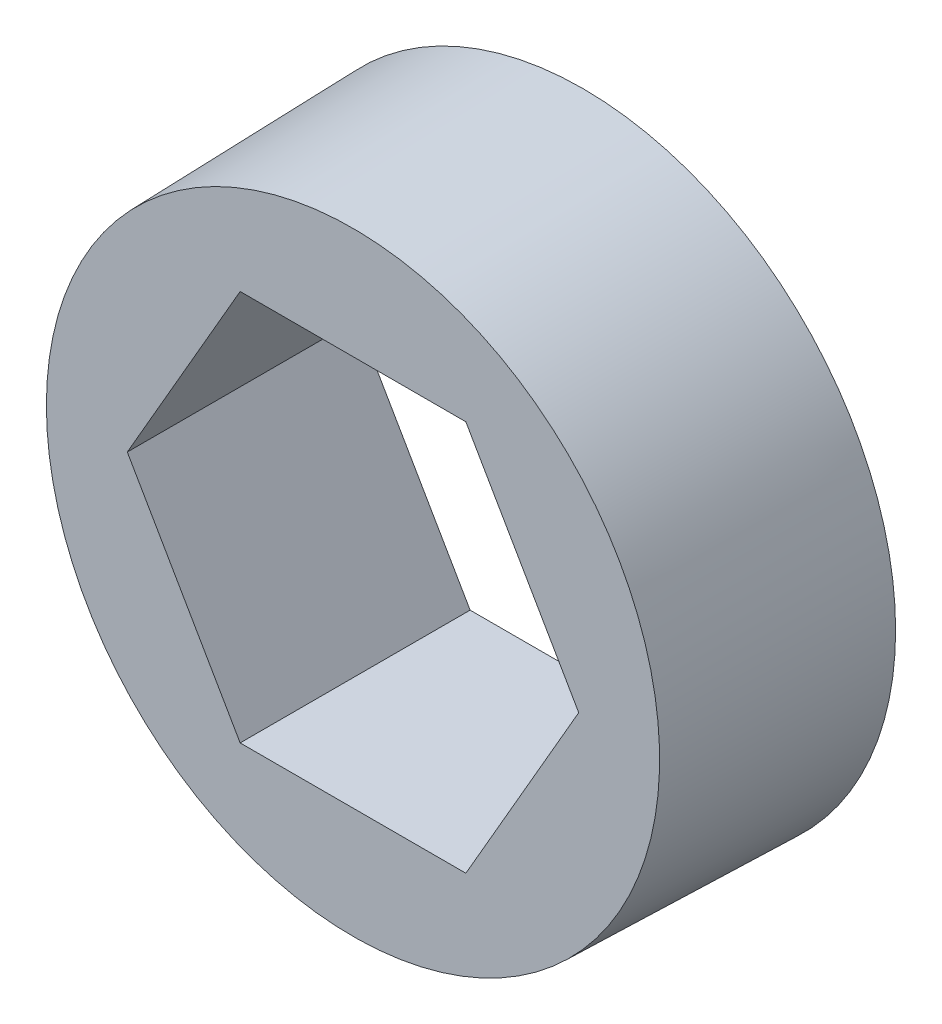
ISO-10303-21;
HEADER;
FILE_DESCRIPTION(('STEP AP214'),'2;1');
FILE_NAME('part.step','',(''),(''),'','','');
FILE_SCHEMA(('AUTOMOTIVE_DESIGN { 1 0 10303 214 1 1 1 1 }'));
ENDSEC;
DATA;
#1=APPLICATION_CONTEXT('core data for automotive mechanical design processes');
#2=APPLICATION_PROTOCOL_DEFINITION('international standard','automotive_design',2000,#1);
#3=PRODUCT_CONTEXT('',#1,'mechanical');
#4=PRODUCT('Part','Part','',(#3));
#5=PRODUCT_RELATED_PRODUCT_CATEGORY('part','',(#4));
#6=PRODUCT_DEFINITION_FORMATION('','',#4);
#7=PRODUCT_DEFINITION_CONTEXT('part definition',#1,'design');
#8=PRODUCT_DEFINITION('design','',#6,#7);
#9=PRODUCT_DEFINITION_SHAPE('','',#8);
#10=(LENGTH_UNIT() NAMED_UNIT(*) SI_UNIT(.MILLI.,.METRE.));
#11=(NAMED_UNIT(*) PLANE_ANGLE_UNIT() SI_UNIT($,.RADIAN.));
#12=(NAMED_UNIT(*) SI_UNIT($,.STERADIAN.) SOLID_ANGLE_UNIT());
#13=UNCERTAINTY_MEASURE_WITH_UNIT(LENGTH_MEASURE(1.E-05),#10,'distance_accuracy_value','');
#14=(GEOMETRIC_REPRESENTATION_CONTEXT(3) GLOBAL_UNCERTAINTY_ASSIGNED_CONTEXT((#13)) GLOBAL_UNIT_ASSIGNED_CONTEXT((#10,
#11,#12)) REPRESENTATION_CONTEXT('',''));
#15=CARTESIAN_POINT('',(0.,0.,0.));
#16=DIRECTION('',(0.,0.,1.));
#17=DIRECTION('',(1.,0.,0.));
#18=AXIS2_PLACEMENT_3D('',#15,#16,#17);
#19=CARTESIAN_POINT('',(-1.47224318643354,-2.55,0.));
#20=DIRECTION('',(0.,-1.,0.));
#21=DIRECTION('',(0.,0.,-1.));
#22=AXIS2_PLACEMENT_3D('',#19,#20,#21);
#23=PLANE('',#22);
#24=DIRECTION('',(0.,0.,1.));
#25=VECTOR('',#24,1.);
#26=CARTESIAN_POINT('',(-1.47224318643355,-2.55,0.));
#27=LINE('',#26,#25);
#28=CARTESIAN_POINT('',(-1.47224318643355,-2.55,-1.5));
#29=VERTEX_POINT('',#28);
#30=CARTESIAN_POINT('',(-1.47224318643355,-2.55,1.5));
#31=VERTEX_POINT('',#30);
#32=EDGE_CURVE('E96',#29,#31,#27,.T.);
#33=ORIENTED_EDGE('',*,*,#32,.T.);
#34=DIRECTION('',(1.,0.,0.));
#35=VECTOR('',#34,1.);
#36=CARTESIAN_POINT('',(0.,-2.55,1.5));
#37=LINE('',#36,#35);
#38=CARTESIAN_POINT('',(1.47224318643355,-2.55,1.5));
#39=VERTEX_POINT('',#38);
#40=EDGE_CURVE('E82',#39,#31,#37,.F.);
#41=ORIENTED_EDGE('',*,*,#40,.F.);
#42=DIRECTION('',(0.,0.,1.));
#43=VECTOR('',#42,1.);
#44=CARTESIAN_POINT('',(1.47224318643355,-2.55,0.));
#45=LINE('',#44,#43);
#46=CARTESIAN_POINT('',(1.47224318643355,-2.55,-1.5));
#47=VERTEX_POINT('',#46);
#48=EDGE_CURVE('E74',#39,#47,#45,.F.);
#49=ORIENTED_EDGE('',*,*,#48,.T.);
#50=DIRECTION('',(1.,0.,0.));
#51=VECTOR('',#50,1.);
#52=CARTESIAN_POINT('',(0.,-2.55,-1.5));
#53=LINE('',#52,#51);
#54=EDGE_CURVE('E101',#47,#29,#53,.F.);
#55=ORIENTED_EDGE('',*,*,#54,.T.);
#56=EDGE_LOOP('',(#33,#41,#49,#55));
#57=FACE_BOUND('',#56,.T.);
#58=ADVANCED_FACE('F15',(#57),#23,.F.);
#59=CARTESIAN_POINT('',(-2.94448637286709,0.,0.));
#60=DIRECTION('',(-0.866025403784439,-0.5,0.));
#61=DIRECTION('',(0.5,-0.866025403784439,0.));
#62=AXIS2_PLACEMENT_3D('',#59,#60,#61);
#63=PLANE('',#62);
#64=DIRECTION('',(0.,0.,1.));
#65=VECTOR('',#64,1.);
#66=CARTESIAN_POINT('',(-2.94448637286709,0.,0.));
#67=LINE('',#66,#65);
#68=CARTESIAN_POINT('',(-2.94448637286709,0.,-1.5));
#69=VERTEX_POINT('',#68);
#70=CARTESIAN_POINT('',(-2.94448637286709,0.,1.5));
#71=VERTEX_POINT('',#70);
#72=EDGE_CURVE('E94',#69,#71,#67,.T.);
#73=ORIENTED_EDGE('',*,*,#72,.T.);
#74=DIRECTION('',(-0.5,0.866025403784439,0.));
#75=VECTOR('',#74,1.);
#76=CARTESIAN_POINT('',(-1.47224318643355,-2.55,1.5));
#77=LINE('',#76,#75);
#78=EDGE_CURVE('E105',#31,#71,#77,.T.);
#79=ORIENTED_EDGE('',*,*,#78,.F.);
#80=ORIENTED_EDGE('',*,*,#32,.F.);
#81=DIRECTION('',(-0.5,0.866025403784439,0.));
#82=VECTOR('',#81,1.);
#83=CARTESIAN_POINT('',(-1.47224318643355,-2.55,-1.5));
#84=LINE('',#83,#82);
#85=EDGE_CURVE('E115',#29,#69,#84,.T.);
#86=ORIENTED_EDGE('',*,*,#85,.T.);
#87=EDGE_LOOP('',(#73,#79,#80,#86));
#88=FACE_BOUND('',#87,.T.);
#89=ADVANCED_FACE('F106',(#88),#63,.F.);
#90=CARTESIAN_POINT('',(-1.47224318643355,2.55,0.));
#91=DIRECTION('',(-0.866025403784439,0.5,0.));
#92=DIRECTION('',(-0.5,-0.866025403784439,0.));
#93=AXIS2_PLACEMENT_3D('',#90,#91,#92);
#94=PLANE('',#93);
#95=DIRECTION('',(0.,0.,1.));
#96=VECTOR('',#95,1.);
#97=CARTESIAN_POINT('',(-1.47224318643355,2.55,0.));
#98=LINE('',#97,#96);
#99=CARTESIAN_POINT('',(-1.47224318643355,2.55,-1.5));
#100=VERTEX_POINT('',#99);
#101=CARTESIAN_POINT('',(-1.47224318643355,2.55,1.5));
#102=VERTEX_POINT('',#101);
#103=EDGE_CURVE('E92',#100,#102,#98,.T.);
#104=ORIENTED_EDGE('',*,*,#103,.T.);
#105=DIRECTION('',(0.5,0.866025403784439,0.));
#106=VECTOR('',#105,1.);
#107=CARTESIAN_POINT('',(-2.94448637286709,0.,1.5));
#108=LINE('',#107,#106);
#109=EDGE_CURVE('E109',#71,#102,#108,.T.);
#110=ORIENTED_EDGE('',*,*,#109,.F.);
#111=ORIENTED_EDGE('',*,*,#72,.F.);
#112=DIRECTION('',(0.5,0.866025403784439,0.));
#113=VECTOR('',#112,1.);
#114=CARTESIAN_POINT('',(-2.94448637286709,0.,-1.5));
#115=LINE('',#114,#113);
#116=EDGE_CURVE('E117',#69,#100,#115,.T.);
#117=ORIENTED_EDGE('',*,*,#116,.T.);
#118=EDGE_LOOP('',(#104,#110,#111,#117));
#119=FACE_BOUND('',#118,.T.);
#120=ADVANCED_FACE('F149',(#119),#94,.F.);
#121=CARTESIAN_POINT('',(1.47224318643355,2.55,0.));
#122=DIRECTION('',(0.,1.,0.));
#123=DIRECTION('',(0.,0.,1.));
#124=AXIS2_PLACEMENT_3D('',#121,#122,#123);
#125=PLANE('',#124);
#126=DIRECTION('',(0.,0.,1.));
#127=VECTOR('',#126,1.);
#128=CARTESIAN_POINT('',(1.47224318643355,2.55,0.));
#129=LINE('',#128,#127);
#130=CARTESIAN_POINT('',(1.47224318643355,2.55,-1.5));
#131=VERTEX_POINT('',#130);
#132=CARTESIAN_POINT('',(1.47224318643355,2.55,1.5));
#133=VERTEX_POINT('',#132);
#134=EDGE_CURVE('E63',#131,#133,#129,.T.);
#135=ORIENTED_EDGE('',*,*,#134,.T.);
#136=DIRECTION('',(1.,0.,0.));
#137=VECTOR('',#136,1.);
#138=CARTESIAN_POINT('',(0.,2.55,1.5));
#139=LINE('',#138,#137);
#140=EDGE_CURVE('E86',#102,#133,#139,.T.);
#141=ORIENTED_EDGE('',*,*,#140,.F.);
#142=ORIENTED_EDGE('',*,*,#103,.F.);
#143=DIRECTION('',(1.,0.,0.));
#144=VECTOR('',#143,1.);
#145=CARTESIAN_POINT('',(0.,2.55,-1.5));
#146=LINE('',#145,#144);
#147=EDGE_CURVE('E119',#100,#131,#146,.T.);
#148=ORIENTED_EDGE('',*,*,#147,.T.);
#149=EDGE_LOOP('',(#135,#141,#142,#148));
#150=FACE_BOUND('',#149,.T.);
#151=ADVANCED_FACE('F151',(#150),#125,.F.);
#152=CARTESIAN_POINT('',(2.94448637286709,0.,0.));
#153=DIRECTION('',(0.866025403784439,0.5,0.));
#154=DIRECTION('',(-0.5,0.866025403784439,0.));
#155=AXIS2_PLACEMENT_3D('',#152,#153,#154);
#156=PLANE('',#155);
#157=DIRECTION('',(0.,0.,1.));
#158=VECTOR('',#157,1.);
#159=CARTESIAN_POINT('',(2.94448637286709,0.,0.));
#160=LINE('',#159,#158);
#161=CARTESIAN_POINT('',(2.94448637286709,0.,-1.5));
#162=VERTEX_POINT('',#161);
#163=CARTESIAN_POINT('',(2.94448637286709,0.,1.5));
#164=VERTEX_POINT('',#163);
#165=EDGE_CURVE('E65',#162,#164,#160,.T.);
#166=ORIENTED_EDGE('',*,*,#165,.T.);
#167=DIRECTION('',(0.5,-0.866025403784439,0.));
#168=VECTOR('',#167,1.);
#169=CARTESIAN_POINT('',(1.47224318643355,2.55,1.5));
#170=LINE('',#169,#168);
#171=EDGE_CURVE('E69',#133,#164,#170,.T.);
#172=ORIENTED_EDGE('',*,*,#171,.F.);
#173=ORIENTED_EDGE('',*,*,#134,.F.);
#174=DIRECTION('',(0.5,-0.866025403784439,0.));
#175=VECTOR('',#174,1.);
#176=CARTESIAN_POINT('',(1.47224318643355,2.55,-1.5));
#177=LINE('',#176,#175);
#178=EDGE_CURVE('E31',#131,#162,#177,.T.);
#179=ORIENTED_EDGE('',*,*,#178,.T.);
#180=EDGE_LOOP('',(#166,#172,#173,#179));
#181=FACE_BOUND('',#180,.T.);
#182=ADVANCED_FACE('F67',(#181),#156,.F.);
#183=CARTESIAN_POINT('',(1.47224318643355,-2.55,0.));
#184=DIRECTION('',(0.866025403784439,-0.5,0.));
#185=DIRECTION('',(0.5,0.866025403784439,0.));
#186=AXIS2_PLACEMENT_3D('',#183,#184,#185);
#187=PLANE('',#186);
#188=ORIENTED_EDGE('',*,*,#48,.F.);
#189=DIRECTION('',(-0.5,-0.866025403784439,0.));
#190=VECTOR('',#189,1.);
#191=CARTESIAN_POINT('',(2.94448637286709,0.,1.5));
#192=LINE('',#191,#190);
#193=EDGE_CURVE('E77',#164,#39,#192,.T.);
#194=ORIENTED_EDGE('',*,*,#193,.F.);
#195=ORIENTED_EDGE('',*,*,#165,.F.);
#196=DIRECTION('',(-0.5,-0.866025403784439,0.));
#197=VECTOR('',#196,1.);
#198=CARTESIAN_POINT('',(2.94448637286709,0.,-1.5));
#199=LINE('',#198,#197);
#200=EDGE_CURVE('E122',#162,#47,#199,.T.);
#201=ORIENTED_EDGE('',*,*,#200,.T.);
#202=EDGE_LOOP('',(#188,#194,#195,#201));
#203=FACE_BOUND('',#202,.T.);
#204=ADVANCED_FACE('F78',(#203),#187,.F.);
#205=CARTESIAN_POINT('',(0.,0.,1.5));
#206=DIRECTION('',(0.,0.,1.));
#207=DIRECTION('',(1.,0.,0.));
#208=AXIS2_PLACEMENT_3D('',#205,#206,#207);
#209=PLANE('',#208);
#210=CARTESIAN_POINT('',(0.,0.,1.50000000002137));
#211=DIRECTION('',(0.,0.,-1.));
#212=DIRECTION('',(-1.,0.,0.));
#213=AXIS2_PLACEMENT_3D('',#210,#211,#212);
#214=CIRCLE('',#213,3.99999999999778);
#215=CARTESIAN_POINT('',(-3.99999999999778,0.,1.50000000002137));
#216=VERTEX_POINT('',#215);
#217=EDGE_CURVE('E18',#216,#216,#214,.T.);
#218=ORIENTED_EDGE('',*,*,#217,.F.);
#219=EDGE_LOOP('',(#218));
#220=FACE_BOUND('',#219,.T.);
#221=ORIENTED_EDGE('',*,*,#109,.T.);
#222=ORIENTED_EDGE('',*,*,#140,.T.);
#223=ORIENTED_EDGE('',*,*,#171,.T.);
#224=ORIENTED_EDGE('',*,*,#193,.T.);
#225=ORIENTED_EDGE('',*,*,#40,.T.);
#226=ORIENTED_EDGE('',*,*,#78,.T.);
#227=EDGE_LOOP('',(#221,#222,#223,#224,#225,#226));
#228=FACE_BOUND('',#227,.T.);
#229=ADVANCED_FACE('F85',(#220,#228),#209,.T.);
#230=CARTESIAN_POINT('',(0.,0.,-1.5));
#231=DIRECTION('',(0.,0.,1.));
#232=DIRECTION('',(1.,0.,0.));
#233=AXIS2_PLACEMENT_3D('',#230,#231,#232);
#234=PLANE('',#233);
#235=CARTESIAN_POINT('',(0.,0.,-1.50000000002137));
#236=DIRECTION('',(0.,0.,-1.));
#237=DIRECTION('',(-1.,0.,0.));
#238=AXIS2_PLACEMENT_3D('',#235,#236,#237);
#239=CIRCLE('',#238,4.0785577646183);
#240=CARTESIAN_POINT('',(-4.0785577646183,0.,-1.50000000002137));
#241=VERTEX_POINT('',#240);
#242=EDGE_CURVE('E10',#241,#241,#239,.F.);
#243=ORIENTED_EDGE('',*,*,#242,.F.);
#244=EDGE_LOOP('',(#243));
#245=FACE_BOUND('',#244,.T.);
#246=ORIENTED_EDGE('',*,*,#178,.F.);
#247=ORIENTED_EDGE('',*,*,#147,.F.);
#248=ORIENTED_EDGE('',*,*,#116,.F.);
#249=ORIENTED_EDGE('',*,*,#85,.F.);
#250=ORIENTED_EDGE('',*,*,#54,.F.);
#251=ORIENTED_EDGE('',*,*,#200,.F.);
#252=EDGE_LOOP('',(#246,#247,#248,#249,#250,#251));
#253=FACE_BOUND('',#252,.T.);
#254=ADVANCED_FACE('F129',(#245,#253),#234,.F.);
#255=CARTESIAN_POINT('',(0.,0.,-1.50000000002137));
#256=DIRECTION('',(0.,0.,-1.));
#257=DIRECTION('',(-1.,0.,0.));
#258=AXIS2_PLACEMENT_3D('',#255,#256,#257);
#259=CONICAL_SURFACE('',#258,4.0785577646183,0.0261799387505459);
#260=ORIENTED_EDGE('',*,*,#242,.T.);
#261=EDGE_LOOP('',(#260));
#262=FACE_BOUND('',#261,.T.);
#263=ORIENTED_EDGE('',*,*,#217,.T.);
#264=EDGE_LOOP('',(#263));
#265=FACE_BOUND('',#264,.T.);
#266=ADVANCED_FACE('F126',(#262,#265),#259,.T.);
#267=CLOSED_SHELL('',(#58,#89,#120,#151,#182,#204,#229,#254,#266));
#268=MANIFOLD_SOLID_BREP('B1',#267);
#269=ADVANCED_BREP_SHAPE_REPRESENTATION('',(#18,#268),#14);
#270=SHAPE_DEFINITION_REPRESENTATION(#9,#269);
ENDSEC;
END-ISO-10303-21;
